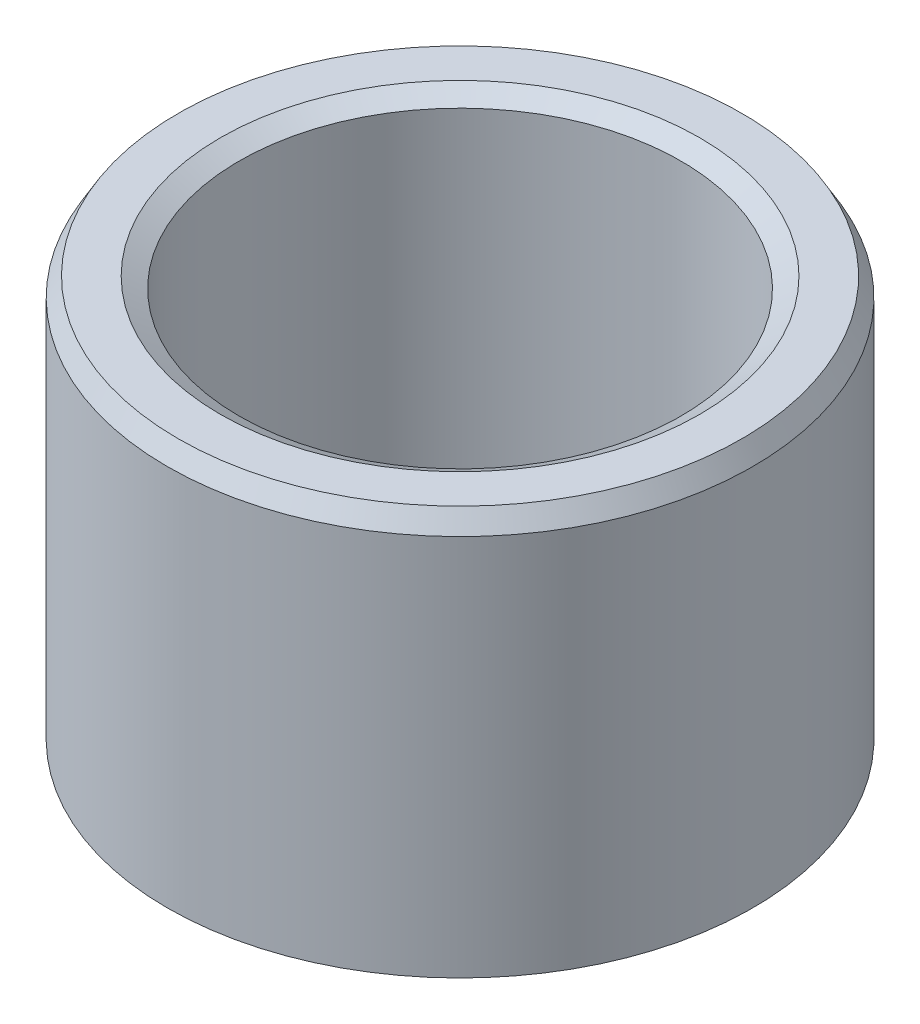
ISO-10303-21;
HEADER;
FILE_DESCRIPTION(('STEP AP214'),'2;1');
FILE_NAME('part.step','',(''),(''),'','','');
FILE_SCHEMA(('AUTOMOTIVE_DESIGN { 1 0 10303 214 1 1 1 1 }'));
ENDSEC;
DATA;
#1=APPLICATION_CONTEXT('core data for automotive mechanical design processes');
#2=APPLICATION_PROTOCOL_DEFINITION('international standard','automotive_design',2000,#1);
#3=PRODUCT_CONTEXT('',#1,'mechanical');
#4=PRODUCT('Part','Part','',(#3));
#5=PRODUCT_RELATED_PRODUCT_CATEGORY('part','',(#4));
#6=PRODUCT_DEFINITION_FORMATION('','',#4);
#7=PRODUCT_DEFINITION_CONTEXT('part definition',#1,'design');
#8=PRODUCT_DEFINITION('design','',#6,#7);
#9=PRODUCT_DEFINITION_SHAPE('','',#8);
#10=(LENGTH_UNIT() NAMED_UNIT(*) SI_UNIT(.MILLI.,.METRE.));
#11=(NAMED_UNIT(*) PLANE_ANGLE_UNIT() SI_UNIT($,.RADIAN.));
#12=(NAMED_UNIT(*) SI_UNIT($,.STERADIAN.) SOLID_ANGLE_UNIT());
#13=UNCERTAINTY_MEASURE_WITH_UNIT(LENGTH_MEASURE(1.E-05),#10,'distance_accuracy_value','');
#14=(GEOMETRIC_REPRESENTATION_CONTEXT(3) GLOBAL_UNCERTAINTY_ASSIGNED_CONTEXT((#13)) GLOBAL_UNIT_ASSIGNED_CONTEXT((#10,
#11,#12)) REPRESENTATION_CONTEXT('',''));
#15=CARTESIAN_POINT('',(0.,0.,0.));
#16=DIRECTION('',(0.,0.,1.));
#17=DIRECTION('',(1.,0.,0.));
#18=AXIS2_PLACEMENT_3D('',#15,#16,#17);
#19=CARTESIAN_POINT('',(0.,70.351940088611,0.));
#20=DIRECTION('',(0.,-1.,0.));
#21=DIRECTION('',(0.,0.,-1.));
#22=AXIS2_PLACEMENT_3D('',#19,#20,#21);
#23=CYLINDRICAL_SURFACE('',#22,50.);
#24=CARTESIAN_POINT('',(0.,1.84708896598833,0.));
#25=DIRECTION('',(0.,1.,0.));
#26=DIRECTION('',(0.,0.,1.));
#27=AXIS2_PLACEMENT_3D('',#24,#25,#26);
#28=CIRCLE('',#27,50.);
#29=CARTESIAN_POINT('',(0.,1.84708896598833,50.));
#30=VERTEX_POINT('',#29);
#31=EDGE_CURVE('E10',#30,#30,#28,.T.);
#32=ORIENTED_EDGE('',*,*,#31,.T.);
#33=EDGE_LOOP('',(#32));
#34=FACE_BOUND('',#33,.T.);
#35=CARTESIAN_POINT('',(0.,67.1526881534193,0.));
#36=DIRECTION('',(0.,1.,0.));
#37=DIRECTION('',(0.,0.,1.));
#38=AXIS2_PLACEMENT_3D('',#35,#36,#37);
#39=CIRCLE('',#38,50.);
#40=CARTESIAN_POINT('',(0.,67.1526881534193,50.));
#41=VERTEX_POINT('',#40);
#42=EDGE_CURVE('E50',#41,#41,#39,.F.);
#43=ORIENTED_EDGE('',*,*,#42,.T.);
#44=EDGE_LOOP('',(#43));
#45=FACE_BOUND('',#44,.T.);
#46=ADVANCED_FACE('F39',(#34,#45),#23,.T.);
#47=CARTESIAN_POINT('',(0.,70.351940088611,0.));
#48=DIRECTION('',(0.,1.,0.));
#49=DIRECTION('',(0.,0.,1.));
#50=AXIS2_PLACEMENT_3D('',#47,#48,#49);
#51=PLANE('',#50);
#52=CARTESIAN_POINT('',(0.,70.351940088611,0.));
#53=DIRECTION('',(0.,1.,0.));
#54=DIRECTION('',(0.,0.,1.));
#55=AXIS2_PLACEMENT_3D('',#52,#53,#54);
#56=CIRCLE('',#55,40.9441022232862);
#57=CARTESIAN_POINT('',(0.,70.351940088611,40.9441022232862));
#58=VERTEX_POINT('',#57);
#59=EDGE_CURVE('E58',#58,#58,#56,.F.);
#60=ORIENTED_EDGE('',*,*,#59,.T.);
#61=EDGE_LOOP('',(#60));
#62=FACE_BOUND('',#61,.T.);
#63=CARTESIAN_POINT('',(0.,70.351940088611,0.));
#64=DIRECTION('',(0.,1.,0.));
#65=DIRECTION('',(0.,0.,1.));
#66=AXIS2_PLACEMENT_3D('',#63,#64,#65);
#67=CIRCLE('',#66,48.1529110340117);
#68=CARTESIAN_POINT('',(0.,70.351940088611,48.1529110340117));
#69=VERTEX_POINT('',#68);
#70=EDGE_CURVE('E61',#69,#69,#67,.T.);
#71=ORIENTED_EDGE('',*,*,#70,.T.);
#72=EDGE_LOOP('',(#71));
#73=FACE_BOUND('',#72,.T.);
#74=ADVANCED_FACE('F88',(#62,#73),#51,.T.);
#75=CARTESIAN_POINT('',(0.,0.,0.));
#76=DIRECTION('',(0.,1.,0.));
#77=DIRECTION('',(0.,0.,1.));
#78=AXIS2_PLACEMENT_3D('',#75,#76,#77);
#79=PLANE('',#78);
#80=CARTESIAN_POINT('',(0.,0.,0.));
#81=DIRECTION('',(0.,1.,0.));
#82=DIRECTION('',(0.,0.,1.));
#83=AXIS2_PLACEMENT_3D('',#80,#81,#82);
#84=CIRCLE('',#83,39.5919392540829);
#85=CARTESIAN_POINT('',(0.,0.,39.5919392540829));
#86=VERTEX_POINT('',#85);
#87=EDGE_CURVE('E51',#86,#86,#84,.T.);
#88=ORIENTED_EDGE('',*,*,#87,.T.);
#89=EDGE_LOOP('',(#88));
#90=FACE_BOUND('',#89,.T.);
#91=CARTESIAN_POINT('',(0.,0.,0.));
#92=DIRECTION('',(0.,1.,0.));
#93=DIRECTION('',(0.,0.,1.));
#94=AXIS2_PLACEMENT_3D('',#91,#92,#93);
#95=CIRCLE('',#94,46.8007480648083);
#96=CARTESIAN_POINT('',(0.,0.,46.8007480648083));
#97=VERTEX_POINT('',#96);
#98=EDGE_CURVE('E54',#97,#97,#95,.F.);
#99=ORIENTED_EDGE('',*,*,#98,.T.);
#100=EDGE_LOOP('',(#99));
#101=FACE_BOUND('',#100,.T.);
#102=ADVANCED_FACE('F83',(#90,#101),#79,.F.);
#103=CARTESIAN_POINT('',(0.,70.351940088611,0.));
#104=DIRECTION('',(0.,-1.,0.));
#105=DIRECTION('',(0.,0.,-1.));
#106=AXIS2_PLACEMENT_3D('',#103,#104,#105);
#107=CYLINDRICAL_SURFACE('',#106,37.7448502880946);
#108=CARTESIAN_POINT('',(0.,68.5048511226227,0.));
#109=DIRECTION('',(0.,1.,0.));
#110=DIRECTION('',(0.,0.,1.));
#111=AXIS2_PLACEMENT_3D('',#108,#109,#110);
#112=CIRCLE('',#111,37.7448502880946);
#113=CARTESIAN_POINT('',(0.,68.5048511226227,37.7448502880946));
#114=VERTEX_POINT('',#113);
#115=EDGE_CURVE('E67',#114,#114,#112,.T.);
#116=ORIENTED_EDGE('',*,*,#115,.T.);
#117=EDGE_LOOP('',(#116));
#118=FACE_BOUND('',#117,.T.);
#119=CARTESIAN_POINT('',(0.,3.19925193519166,0.));
#120=DIRECTION('',(0.,1.,0.));
#121=DIRECTION('',(0.,0.,1.));
#122=AXIS2_PLACEMENT_3D('',#119,#120,#121);
#123=CIRCLE('',#122,37.7448502880946);
#124=CARTESIAN_POINT('',(0.,3.19925193519166,37.7448502880946));
#125=VERTEX_POINT('',#124);
#126=EDGE_CURVE('E69',#125,#125,#123,.F.);
#127=ORIENTED_EDGE('',*,*,#126,.T.);
#128=EDGE_LOOP('',(#127));
#129=FACE_BOUND('',#128,.T.);
#130=ADVANCED_FACE('F71',(#118,#129),#107,.F.);
#131=CARTESIAN_POINT('',(0.,68.5048511226227,0.));
#132=DIRECTION('',(0.,1.,0.));
#133=DIRECTION('',(0.,0.,1.));
#134=AXIS2_PLACEMENT_3D('',#131,#132,#133);
#135=CONICAL_SURFACE('',#134,37.7448502880946,1.0471975511966);
#136=ORIENTED_EDGE('',*,*,#59,.F.);
#137=EDGE_LOOP('',(#136));
#138=FACE_BOUND('',#137,.T.);
#139=ORIENTED_EDGE('',*,*,#115,.F.);
#140=EDGE_LOOP('',(#139));
#141=FACE_BOUND('',#140,.T.);
#142=ADVANCED_FACE('F77',(#138,#141),#135,.F.);
#143=CARTESIAN_POINT('',(0.,0.,0.));
#144=DIRECTION('',(0.,-1.,0.));
#145=DIRECTION('',(0.,0.,-1.));
#146=AXIS2_PLACEMENT_3D('',#143,#144,#145);
#147=CONICAL_SURFACE('',#146,39.5919392540829,0.523598775598294);
#148=ORIENTED_EDGE('',*,*,#126,.F.);
#149=EDGE_LOOP('',(#148));
#150=FACE_BOUND('',#149,.T.);
#151=ORIENTED_EDGE('',*,*,#87,.F.);
#152=EDGE_LOOP('',(#151));
#153=FACE_BOUND('',#152,.T.);
#154=ADVANCED_FACE('F73',(#150,#153),#147,.F.);
#155=CARTESIAN_POINT('',(0.,1.84708896598833,0.));
#156=DIRECTION('',(0.,1.,0.));
#157=DIRECTION('',(0.,0.,1.));
#158=AXIS2_PLACEMENT_3D('',#155,#156,#157);
#159=CONICAL_SURFACE('',#158,50.,1.0471975511966);
#160=ORIENTED_EDGE('',*,*,#98,.F.);
#161=EDGE_LOOP('',(#160));
#162=FACE_BOUND('',#161,.T.);
#163=ORIENTED_EDGE('',*,*,#31,.F.);
#164=EDGE_LOOP('',(#163));
#165=FACE_BOUND('',#164,.T.);
#166=ADVANCED_FACE('F76',(#162,#165),#159,.T.);
#167=CARTESIAN_POINT('',(0.,70.351940088611,0.));
#168=DIRECTION('',(0.,-1.,0.));
#169=DIRECTION('',(0.,0.,-1.));
#170=AXIS2_PLACEMENT_3D('',#167,#168,#169);
#171=CONICAL_SURFACE('',#170,48.1529110340117,0.523598775598297);
#172=ORIENTED_EDGE('',*,*,#42,.F.);
#173=EDGE_LOOP('',(#172));
#174=FACE_BOUND('',#173,.T.);
#175=ORIENTED_EDGE('',*,*,#70,.F.);
#176=EDGE_LOOP('',(#175));
#177=FACE_BOUND('',#176,.T.);
#178=ADVANCED_FACE('F45',(#174,#177),#171,.T.);
#179=CLOSED_SHELL('',(#46,#74,#102,#130,#142,#154,#166,#178));
#180=MANIFOLD_SOLID_BREP('B2',#179);
#181=ADVANCED_BREP_SHAPE_REPRESENTATION('',(#18,#180),#14);
#182=SHAPE_DEFINITION_REPRESENTATION(#9,#181);
ENDSEC;
END-ISO-10303-21;
